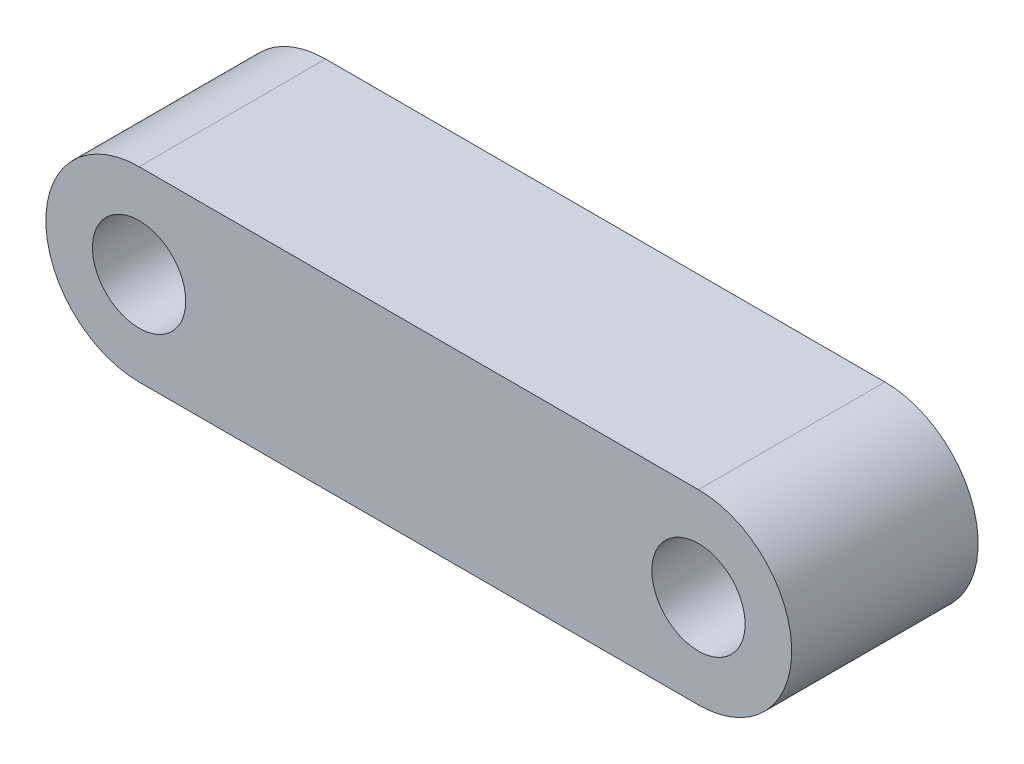
ISO-10303-21;
HEADER;
FILE_DESCRIPTION(('STEP AP214'),'2;1');
FILE_NAME('part.step','',(''),(''),'','','');
FILE_SCHEMA(('AUTOMOTIVE_DESIGN { 1 0 10303 214 1 1 1 1 }'));
ENDSEC;
DATA;
#1=APPLICATION_CONTEXT('core data for automotive mechanical design processes');
#2=APPLICATION_PROTOCOL_DEFINITION('international standard','automotive_design',2000,#1);
#3=PRODUCT_CONTEXT('',#1,'mechanical');
#4=PRODUCT('Part','Part','',(#3));
#5=PRODUCT_RELATED_PRODUCT_CATEGORY('part','',(#4));
#6=PRODUCT_DEFINITION_FORMATION('','',#4);
#7=PRODUCT_DEFINITION_CONTEXT('part definition',#1,'design');
#8=PRODUCT_DEFINITION('design','',#6,#7);
#9=PRODUCT_DEFINITION_SHAPE('','',#8);
#10=(LENGTH_UNIT() NAMED_UNIT(*) SI_UNIT(.MILLI.,.METRE.));
#11=(NAMED_UNIT(*) PLANE_ANGLE_UNIT() SI_UNIT($,.RADIAN.));
#12=(NAMED_UNIT(*) SI_UNIT($,.STERADIAN.) SOLID_ANGLE_UNIT());
#13=UNCERTAINTY_MEASURE_WITH_UNIT(LENGTH_MEASURE(1.E-05),#10,'distance_accuracy_value','');
#14=(GEOMETRIC_REPRESENTATION_CONTEXT(3) GLOBAL_UNCERTAINTY_ASSIGNED_CONTEXT((#13)) GLOBAL_UNIT_ASSIGNED_CONTEXT((#10,
#11,#12)) REPRESENTATION_CONTEXT('',''));
#15=CARTESIAN_POINT('',(0.,0.,0.));
#16=DIRECTION('',(0.,0.,1.));
#17=DIRECTION('',(1.,0.,0.));
#18=AXIS2_PLACEMENT_3D('',#15,#16,#17);
#19=CARTESIAN_POINT('',(-15.,0.,10.));
#20=DIRECTION('',(0.,0.,1.));
#21=DIRECTION('',(1.,0.,0.));
#22=AXIS2_PLACEMENT_3D('',#19,#20,#21);
#23=PLANE('',#22);
#24=CARTESIAN_POINT('',(-15.,0.,10.));
#25=DIRECTION('',(0.,0.,1.));
#26=DIRECTION('',(1.,0.,0.));
#27=AXIS2_PLACEMENT_3D('',#24,#25,#26);
#28=CIRCLE('',#27,2.5);
#29=CARTESIAN_POINT('',(-12.5,0.,10.));
#30=VERTEX_POINT('',#29);
#31=EDGE_CURVE('E115',#30,#30,#28,.T.);
#32=ORIENTED_EDGE('',*,*,#31,.F.);
#33=EDGE_LOOP('',(#32));
#34=FACE_BOUND('',#33,.T.);
#35=CARTESIAN_POINT('',(-15.,0.,10.));
#36=DIRECTION('',(0.,0.,1.));
#37=DIRECTION('',(1.,0.,0.));
#38=AXIS2_PLACEMENT_3D('',#35,#36,#37);
#39=CIRCLE('',#38,5.);
#40=CARTESIAN_POINT('',(-15.,4.99999999999999,10.));
#41=VERTEX_POINT('',#40);
#42=CARTESIAN_POINT('',(-15.,-5.00000000000001,10.));
#43=VERTEX_POINT('',#42);
#44=EDGE_CURVE('E95',#41,#43,#39,.T.);
#45=ORIENTED_EDGE('',*,*,#44,.T.);
#46=DIRECTION('',(1.,0.,0.));
#47=VECTOR('',#46,1.);
#48=CARTESIAN_POINT('',(-15.,-5.00000000000001,10.));
#49=LINE('',#48,#47);
#50=CARTESIAN_POINT('',(15.,-5.,10.));
#51=VERTEX_POINT('',#50);
#52=EDGE_CURVE('E90',#43,#51,#49,.T.);
#53=ORIENTED_EDGE('',*,*,#52,.T.);
#54=CARTESIAN_POINT('',(15.,0.,10.));
#55=DIRECTION('',(0.,0.,1.));
#56=DIRECTION('',(1.,0.,0.));
#57=AXIS2_PLACEMENT_3D('',#54,#55,#56);
#58=CIRCLE('',#57,5.);
#59=CARTESIAN_POINT('',(15.,4.99999999999999,10.));
#60=VERTEX_POINT('',#59);
#61=EDGE_CURVE('E93',#51,#60,#58,.T.);
#62=ORIENTED_EDGE('',*,*,#61,.T.);
#63=DIRECTION('',(-1.,0.,0.));
#64=VECTOR('',#63,1.);
#65=CARTESIAN_POINT('',(-15.,4.99999999999999,10.));
#66=LINE('',#65,#64);
#67=EDGE_CURVE('E60',#60,#41,#66,.T.);
#68=ORIENTED_EDGE('',*,*,#67,.T.);
#69=EDGE_LOOP('',(#45,#53,#62,#68));
#70=FACE_BOUND('',#69,.T.);
#71=CARTESIAN_POINT('',(15.,0.,10.));
#72=DIRECTION('',(0.,0.,1.));
#73=DIRECTION('',(1.,0.,0.));
#74=AXIS2_PLACEMENT_3D('',#71,#72,#73);
#75=CIRCLE('',#74,2.50000000000001);
#76=CARTESIAN_POINT('',(17.5,0.,10.));
#77=VERTEX_POINT('',#76);
#78=EDGE_CURVE('E137',#77,#77,#75,.T.);
#79=ORIENTED_EDGE('',*,*,#78,.F.);
#80=EDGE_LOOP('',(#79));
#81=FACE_BOUND('',#80,.T.);
#82=ADVANCED_FACE('F42',(#34,#70,#81),#23,.T.);
#83=CARTESIAN_POINT('',(-15.,0.,0.));
#84=DIRECTION('',(0.,0.,1.));
#85=DIRECTION('',(1.,0.,0.));
#86=AXIS2_PLACEMENT_3D('',#83,#84,#85);
#87=PLANE('',#86);
#88=CARTESIAN_POINT('',(-15.,0.,0.));
#89=DIRECTION('',(0.,0.,1.));
#90=DIRECTION('',(1.,0.,0.));
#91=AXIS2_PLACEMENT_3D('',#88,#89,#90);
#92=CIRCLE('',#91,5.);
#93=CARTESIAN_POINT('',(-15.,4.99999999999999,0.));
#94=VERTEX_POINT('',#93);
#95=CARTESIAN_POINT('',(-15.,-5.00000000000001,0.));
#96=VERTEX_POINT('',#95);
#97=EDGE_CURVE('E111',#94,#96,#92,.T.);
#98=ORIENTED_EDGE('',*,*,#97,.F.);
#99=DIRECTION('',(-1.,0.,0.));
#100=VECTOR('',#99,1.);
#101=CARTESIAN_POINT('',(-15.,4.99999999999999,0.));
#102=LINE('',#101,#100);
#103=CARTESIAN_POINT('',(15.,4.99999999999999,0.));
#104=VERTEX_POINT('',#103);
#105=EDGE_CURVE('E83',#104,#94,#102,.T.);
#106=ORIENTED_EDGE('',*,*,#105,.F.);
#107=CARTESIAN_POINT('',(15.,0.,0.));
#108=DIRECTION('',(0.,0.,1.));
#109=DIRECTION('',(1.,0.,0.));
#110=AXIS2_PLACEMENT_3D('',#107,#108,#109);
#111=CIRCLE('',#110,5.);
#112=CARTESIAN_POINT('',(15.,-5.,0.));
#113=VERTEX_POINT('',#112);
#114=EDGE_CURVE('E77',#113,#104,#111,.T.);
#115=ORIENTED_EDGE('',*,*,#114,.F.);
#116=DIRECTION('',(1.,0.,0.));
#117=VECTOR('',#116,1.);
#118=CARTESIAN_POINT('',(-15.,-5.00000000000001,0.));
#119=LINE('',#118,#117);
#120=EDGE_CURVE('E100',#96,#113,#119,.T.);
#121=ORIENTED_EDGE('',*,*,#120,.F.);
#122=EDGE_LOOP('',(#98,#106,#115,#121));
#123=FACE_BOUND('',#122,.T.);
#124=CARTESIAN_POINT('',(-15.,0.,0.));
#125=DIRECTION('',(0.,0.,1.));
#126=DIRECTION('',(1.,0.,0.));
#127=AXIS2_PLACEMENT_3D('',#124,#125,#126);
#128=CIRCLE('',#127,2.5);
#129=CARTESIAN_POINT('',(-12.5,0.,0.));
#130=VERTEX_POINT('',#129);
#131=EDGE_CURVE('E133',#130,#130,#128,.T.);
#132=ORIENTED_EDGE('',*,*,#131,.T.);
#133=EDGE_LOOP('',(#132));
#134=FACE_BOUND('',#133,.T.);
#135=CARTESIAN_POINT('',(15.,0.,0.));
#136=DIRECTION('',(0.,0.,1.));
#137=DIRECTION('',(1.,0.,0.));
#138=AXIS2_PLACEMENT_3D('',#135,#136,#137);
#139=CIRCLE('',#138,2.50000000000001);
#140=CARTESIAN_POINT('',(17.5,0.,0.));
#141=VERTEX_POINT('',#140);
#142=EDGE_CURVE('E141',#141,#141,#139,.T.);
#143=ORIENTED_EDGE('',*,*,#142,.T.);
#144=EDGE_LOOP('',(#143));
#145=FACE_BOUND('',#144,.T.);
#146=ADVANCED_FACE('F128',(#123,#134,#145),#87,.F.);
#147=CARTESIAN_POINT('',(-15.,0.,10.));
#148=DIRECTION('',(0.,0.,-1.));
#149=DIRECTION('',(-1.,0.,0.));
#150=AXIS2_PLACEMENT_3D('',#147,#148,#149);
#151=CYLINDRICAL_SURFACE('',#150,5.);
#152=ORIENTED_EDGE('',*,*,#97,.T.);
#153=DIRECTION('',(0.,0.,-1.));
#154=VECTOR('',#153,1.);
#155=CARTESIAN_POINT('',(-15.,-5.00000000000001,10.));
#156=LINE('',#155,#154);
#157=EDGE_CURVE('E11',#43,#96,#156,.T.);
#158=ORIENTED_EDGE('',*,*,#157,.F.);
#159=ORIENTED_EDGE('',*,*,#44,.F.);
#160=DIRECTION('',(0.,0.,-1.));
#161=VECTOR('',#160,1.);
#162=CARTESIAN_POINT('',(-15.,4.99999999999999,10.));
#163=LINE('',#162,#161);
#164=EDGE_CURVE('E107',#41,#94,#163,.T.);
#165=ORIENTED_EDGE('',*,*,#164,.T.);
#166=EDGE_LOOP('',(#152,#158,#159,#165));
#167=FACE_BOUND('',#166,.T.);
#168=ADVANCED_FACE('F44',(#167),#151,.T.);
#169=CARTESIAN_POINT('',(-15.,-5.00000000000001,10.));
#170=DIRECTION('',(0.,1.,0.));
#171=DIRECTION('',(-1.,0.,0.));
#172=AXIS2_PLACEMENT_3D('',#169,#170,#171);
#173=PLANE('',#172);
#174=ORIENTED_EDGE('',*,*,#120,.T.);
#175=DIRECTION('',(0.,0.,-1.));
#176=VECTOR('',#175,1.);
#177=CARTESIAN_POINT('',(15.,-5.,10.));
#178=LINE('',#177,#176);
#179=EDGE_CURVE('E52',#51,#113,#178,.T.);
#180=ORIENTED_EDGE('',*,*,#179,.F.);
#181=ORIENTED_EDGE('',*,*,#52,.F.);
#182=ORIENTED_EDGE('',*,*,#157,.T.);
#183=EDGE_LOOP('',(#174,#180,#181,#182));
#184=FACE_BOUND('',#183,.T.);
#185=ADVANCED_FACE('F99',(#184),#173,.F.);
#186=CARTESIAN_POINT('',(15.,0.,10.));
#187=DIRECTION('',(0.,0.,-1.));
#188=DIRECTION('',(-1.,0.,0.));
#189=AXIS2_PLACEMENT_3D('',#186,#187,#188);
#190=CYLINDRICAL_SURFACE('',#189,5.);
#191=ORIENTED_EDGE('',*,*,#114,.T.);
#192=DIRECTION('',(0.,0.,-1.));
#193=VECTOR('',#192,1.);
#194=CARTESIAN_POINT('',(15.,4.99999999999999,10.));
#195=LINE('',#194,#193);
#196=EDGE_CURVE('E102',#60,#104,#195,.T.);
#197=ORIENTED_EDGE('',*,*,#196,.F.);
#198=ORIENTED_EDGE('',*,*,#61,.F.);
#199=ORIENTED_EDGE('',*,*,#179,.T.);
#200=EDGE_LOOP('',(#191,#197,#198,#199));
#201=FACE_BOUND('',#200,.T.);
#202=ADVANCED_FACE('F103',(#201),#190,.T.);
#203=CARTESIAN_POINT('',(-15.,4.99999999999999,10.));
#204=DIRECTION('',(0.,-1.,0.));
#205=DIRECTION('',(1.,0.,0.));
#206=AXIS2_PLACEMENT_3D('',#203,#204,#205);
#207=PLANE('',#206);
#208=ORIENTED_EDGE('',*,*,#105,.T.);
#209=ORIENTED_EDGE('',*,*,#164,.F.);
#210=ORIENTED_EDGE('',*,*,#67,.F.);
#211=ORIENTED_EDGE('',*,*,#196,.T.);
#212=EDGE_LOOP('',(#208,#209,#210,#211));
#213=FACE_BOUND('',#212,.T.);
#214=ADVANCED_FACE('F125',(#213),#207,.F.);
#215=CARTESIAN_POINT('',(-15.,0.,10.));
#216=DIRECTION('',(0.,0.,-1.));
#217=DIRECTION('',(-1.,0.,0.));
#218=AXIS2_PLACEMENT_3D('',#215,#216,#217);
#219=CYLINDRICAL_SURFACE('',#218,2.5);
#220=ORIENTED_EDGE('',*,*,#31,.T.);
#221=EDGE_LOOP('',(#220));
#222=FACE_BOUND('',#221,.T.);
#223=ORIENTED_EDGE('',*,*,#131,.F.);
#224=EDGE_LOOP('',(#223));
#225=FACE_BOUND('',#224,.T.);
#226=ADVANCED_FACE('F160',(#222,#225),#219,.F.);
#227=CARTESIAN_POINT('',(15.,0.,10.));
#228=DIRECTION('',(0.,0.,-1.));
#229=DIRECTION('',(-1.,0.,0.));
#230=AXIS2_PLACEMENT_3D('',#227,#228,#229);
#231=CYLINDRICAL_SURFACE('',#230,2.50000000000001);
#232=ORIENTED_EDGE('',*,*,#78,.T.);
#233=EDGE_LOOP('',(#232));
#234=FACE_BOUND('',#233,.T.);
#235=ORIENTED_EDGE('',*,*,#142,.F.);
#236=EDGE_LOOP('',(#235));
#237=FACE_BOUND('',#236,.T.);
#238=ADVANCED_FACE('F149',(#234,#237),#231,.F.);
#239=CLOSED_SHELL('',(#82,#146,#168,#185,#202,#214,#226,#238));
#240=MANIFOLD_SOLID_BREP('B2',#239);
#241=ADVANCED_BREP_SHAPE_REPRESENTATION('',(#18,#240),#14);
#242=SHAPE_DEFINITION_REPRESENTATION(#9,#241);
ENDSEC;
END-ISO-10303-21;
